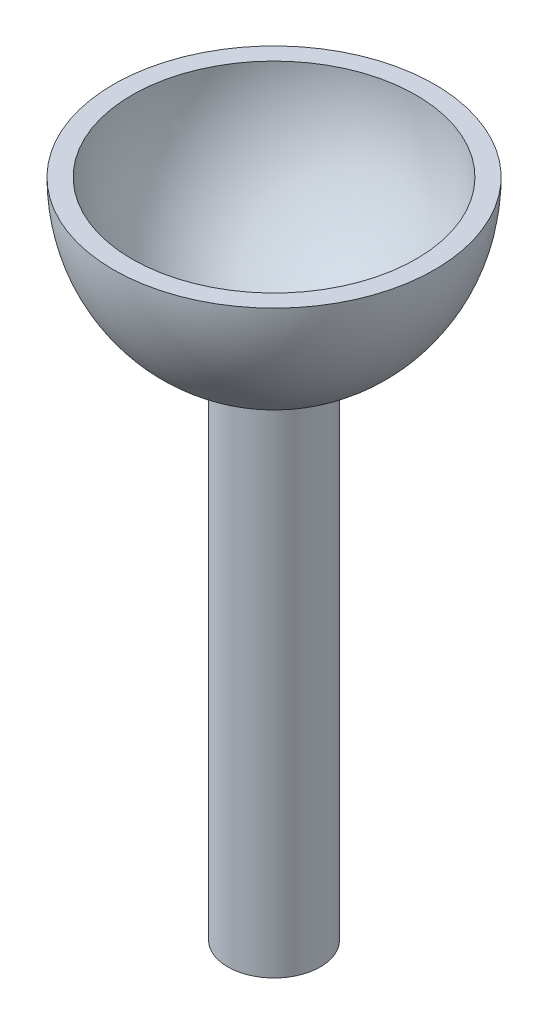
ISO-10303-21;
HEADER;
FILE_DESCRIPTION(('STEP AP214'),'2;1');
FILE_NAME('part.step','',(''),(''),'','','');
FILE_SCHEMA(('AUTOMOTIVE_DESIGN { 1 0 10303 214 1 1 1 1 }'));
ENDSEC;
DATA;
#1=APPLICATION_CONTEXT('core data for automotive mechanical design processes');
#2=APPLICATION_PROTOCOL_DEFINITION('international standard','automotive_design',2000,#1);
#3=PRODUCT_CONTEXT('',#1,'mechanical');
#4=PRODUCT('Part','Part','',(#3));
#5=PRODUCT_RELATED_PRODUCT_CATEGORY('part','',(#4));
#6=PRODUCT_DEFINITION_FORMATION('','',#4);
#7=PRODUCT_DEFINITION_CONTEXT('part definition',#1,'design');
#8=PRODUCT_DEFINITION('design','',#6,#7);
#9=PRODUCT_DEFINITION_SHAPE('','',#8);
#10=(LENGTH_UNIT() NAMED_UNIT(*) SI_UNIT(.MILLI.,.METRE.));
#11=(NAMED_UNIT(*) PLANE_ANGLE_UNIT() SI_UNIT($,.RADIAN.));
#12=(NAMED_UNIT(*) SI_UNIT($,.STERADIAN.) SOLID_ANGLE_UNIT());
#13=UNCERTAINTY_MEASURE_WITH_UNIT(LENGTH_MEASURE(1.E-05),#10,'distance_accuracy_value','');
#14=(GEOMETRIC_REPRESENTATION_CONTEXT(3) GLOBAL_UNCERTAINTY_ASSIGNED_CONTEXT((#13)) GLOBAL_UNIT_ASSIGNED_CONTEXT((#10,
#11,#12)) REPRESENTATION_CONTEXT('',''));
#15=CARTESIAN_POINT('',(0.,0.,0.));
#16=DIRECTION('',(0.,0.,1.));
#17=DIRECTION('',(1.,0.,0.));
#18=AXIS2_PLACEMENT_3D('',#15,#16,#17);
#19=CARTESIAN_POINT('',(5.50000000000001,3.69644069480111,0.));
#20=CARTESIAN_POINT('',(7.93390428771052,4.3926905683458,0.));
#21=CARTESIAN_POINT('',(12.5802711099199,6.59490545235827,0.));
#22=CARTESIAN_POINT('',(18.2387024596659,12.0367294185437,0.));
#23=CARTESIAN_POINT('',(21.9813269005975,19.0646095689158,0.));
#24=CARTESIAN_POINT('',(22.9352028919529,24.3650522032567,0.));
#25=CARTESIAN_POINT('',(23.,27.,0.));
#26=B_SPLINE_CURVE_WITH_KNOTS('',3,(#19,#20,#21,#22,#23,#24,#25),.UNSPECIFIED.,.F.,.F.,(4,1,1,1,
4),(0.292619685344254,0.612163845706914,0.931708006069575,1.25125216643224,1.5707963267949),.UNSPECIFIED.);
#27=CARTESIAN_POINT('',(0.,27.,0.));
#28=DIRECTION('',(0.,1.,0.));
#29=AXIS1_PLACEMENT('',#27,#28);
#30=SURFACE_OF_REVOLUTION('',#26,#29);
#31=CARTESIAN_POINT('',(0.,27.,0.));
#32=DIRECTION('',(0.,1.,0.));
#33=DIRECTION('',(0.,0.,1.));
#34=AXIS2_PLACEMENT_3D('',#31,#32,#33);
#35=CIRCLE('',#34,23.);
#36=CARTESIAN_POINT('',(0.,27.,23.));
#37=VERTEX_POINT('',#36);
#38=EDGE_CURVE('E56',#37,#37,#35,.T.);
#39=ORIENTED_EDGE('',*,*,#38,.T.);
#40=EDGE_LOOP('',(#39));
#41=FACE_BOUND('',#40,.T.);
#42=CARTESIAN_POINT('',(0.,3.69644069480111,0.));
#43=DIRECTION('',(0.,1.,0.));
#44=DIRECTION('',(0.,0.,1.));
#45=AXIS2_PLACEMENT_3D('',#42,#43,#44);
#46=CIRCLE('',#45,5.5);
#47=CARTESIAN_POINT('',(0.,3.69644069480111,5.5));
#48=VERTEX_POINT('',#47);
#49=EDGE_CURVE('E10',#48,#48,#46,.T.);
#50=ORIENTED_EDGE('',*,*,#49,.F.);
#51=EDGE_LOOP('',(#50));
#52=FACE_BOUND('',#51,.T.);
#53=ADVANCED_FACE('F33',(#41,#52),#30,.F.);
#54=CARTESIAN_POINT('',(0.,27.,0.));
#55=DIRECTION('',(0.,1.,0.));
#56=DIRECTION('',(0.,0.,1.));
#57=AXIS2_PLACEMENT_3D('',#54,#55,#56);
#58=CYLINDRICAL_SURFACE('',#57,5.5);
#59=ORIENTED_EDGE('',*,*,#49,.T.);
#60=EDGE_LOOP('',(#59));
#61=FACE_BOUND('',#60,.T.);
#62=CARTESIAN_POINT('',(0.,-80.,0.));
#63=DIRECTION('',(0.,1.,0.));
#64=DIRECTION('',(0.,0.,1.));
#65=AXIS2_PLACEMENT_3D('',#62,#63,#64);
#66=CIRCLE('',#65,5.5);
#67=CARTESIAN_POINT('',(0.,-80.,5.5));
#68=VERTEX_POINT('',#67);
#69=EDGE_CURVE('E40',#68,#68,#66,.T.);
#70=ORIENTED_EDGE('',*,*,#69,.F.);
#71=EDGE_LOOP('',(#70));
#72=FACE_BOUND('',#71,.T.);
#73=ADVANCED_FACE('F76',(#61,#72),#58,.F.);
#74=CARTESIAN_POINT('',(0.,-80.,0.));
#75=DIRECTION('',(0.,1.,0.));
#76=DIRECTION('',(0.,0.,1.));
#77=AXIS2_PLACEMENT_3D('',#74,#75,#76);
#78=PLANE('',#77);
#79=CARTESIAN_POINT('',(0.,-80.,0.));
#80=DIRECTION('',(0.,1.,0.));
#81=DIRECTION('',(0.,0.,1.));
#82=AXIS2_PLACEMENT_3D('',#79,#80,#81);
#83=CIRCLE('',#82,7.5);
#84=CARTESIAN_POINT('',(0.,-80.,7.5));
#85=VERTEX_POINT('',#84);
#86=EDGE_CURVE('E44',#85,#85,#83,.T.);
#87=ORIENTED_EDGE('',*,*,#86,.F.);
#88=EDGE_LOOP('',(#87));
#89=FACE_BOUND('',#88,.T.);
#90=ORIENTED_EDGE('',*,*,#69,.T.);
#91=EDGE_LOOP('',(#90));
#92=FACE_BOUND('',#91,.T.);
#93=ADVANCED_FACE('F73',(#89,#92),#78,.F.);
#94=CARTESIAN_POINT('',(0.,27.,0.));
#95=DIRECTION('',(0.,1.,0.));
#96=DIRECTION('',(0.,0.,1.));
#97=AXIS2_PLACEMENT_3D('',#94,#95,#96);
#98=CYLINDRICAL_SURFACE('',#97,7.5);
#99=ORIENTED_EDGE('',*,*,#86,.T.);
#100=EDGE_LOOP('',(#99));
#101=FACE_BOUND('',#100,.T.);
#102=CARTESIAN_POINT('',(0.,1.14772994756736,0.));
#103=DIRECTION('',(0.,1.,0.));
#104=DIRECTION('',(0.,0.,1.));
#105=AXIS2_PLACEMENT_3D('',#102,#103,#104);
#106=CIRCLE('',#105,7.5);
#107=CARTESIAN_POINT('',(0.,1.14772994756736,7.5));
#108=VERTEX_POINT('',#107);
#109=EDGE_CURVE('E48',#108,#108,#106,.T.);
#110=ORIENTED_EDGE('',*,*,#109,.F.);
#111=EDGE_LOOP('',(#110));
#112=FACE_BOUND('',#111,.T.);
#113=ADVANCED_FACE('F69',(#101,#112),#98,.T.);
#114=CARTESIAN_POINT('',(0.,27.,0.));
#115=DIRECTION('',(0.,0.,1.));
#116=DIRECTION('',(0.,-1.,0.));
#117=AXIS2_PLACEMENT_3D('',#114,#115,#116);
#118=ELLIPSE('',#117,27.,26.);
#119=TRIMMED_CURVE('',#118,(PARAMETER_VALUE(0.)),(PARAMETER_VALUE(3.14159265358979)),.T.,.PARAMETER.);
#120=CARTESIAN_POINT('',(0.,27.,0.));
#121=DIRECTION('',(0.,1.,0.));
#122=AXIS1_PLACEMENT('',#120,#121);
#123=SURFACE_OF_REVOLUTION('',#119,#122);
#124=CARTESIAN_POINT('',(0.,27.,0.));
#125=DIRECTION('',(0.,1.,0.));
#126=DIRECTION('',(0.,0.,1.));
#127=AXIS2_PLACEMENT_3D('',#124,#125,#126);
#128=CIRCLE('',#127,26.);
#129=CARTESIAN_POINT('',(0.,27.,26.));
#130=VERTEX_POINT('',#129);
#131=EDGE_CURVE('E53',#130,#130,#128,.T.);
#132=ORIENTED_EDGE('',*,*,#131,.F.);
#133=EDGE_LOOP('',(#132));
#134=FACE_BOUND('',#133,.T.);
#135=ORIENTED_EDGE('',*,*,#109,.T.);
#136=EDGE_LOOP('',(#135));
#137=FACE_BOUND('',#136,.T.);
#138=ADVANCED_FACE('F64',(#134,#137),#123,.T.);
#139=CARTESIAN_POINT('',(0.,27.,0.));
#140=DIRECTION('',(0.,1.,0.));
#141=DIRECTION('',(0.,0.,1.));
#142=AXIS2_PLACEMENT_3D('',#139,#140,#141);
#143=PLANE('',#142);
#144=ORIENTED_EDGE('',*,*,#131,.T.);
#145=EDGE_LOOP('',(#144));
#146=FACE_BOUND('',#145,.T.);
#147=ORIENTED_EDGE('',*,*,#38,.F.);
#148=EDGE_LOOP('',(#147));
#149=FACE_BOUND('',#148,.T.);
#150=ADVANCED_FACE('F68',(#146,#149),#143,.T.);
#151=CLOSED_SHELL('',(#53,#73,#93,#113,#138,#150));
#152=MANIFOLD_SOLID_BREP('B2',#151);
#153=ADVANCED_BREP_SHAPE_REPRESENTATION('',(#18,#152),#14);
#154=SHAPE_DEFINITION_REPRESENTATION(#9,#153);
ENDSEC;
END-ISO-10303-21;
